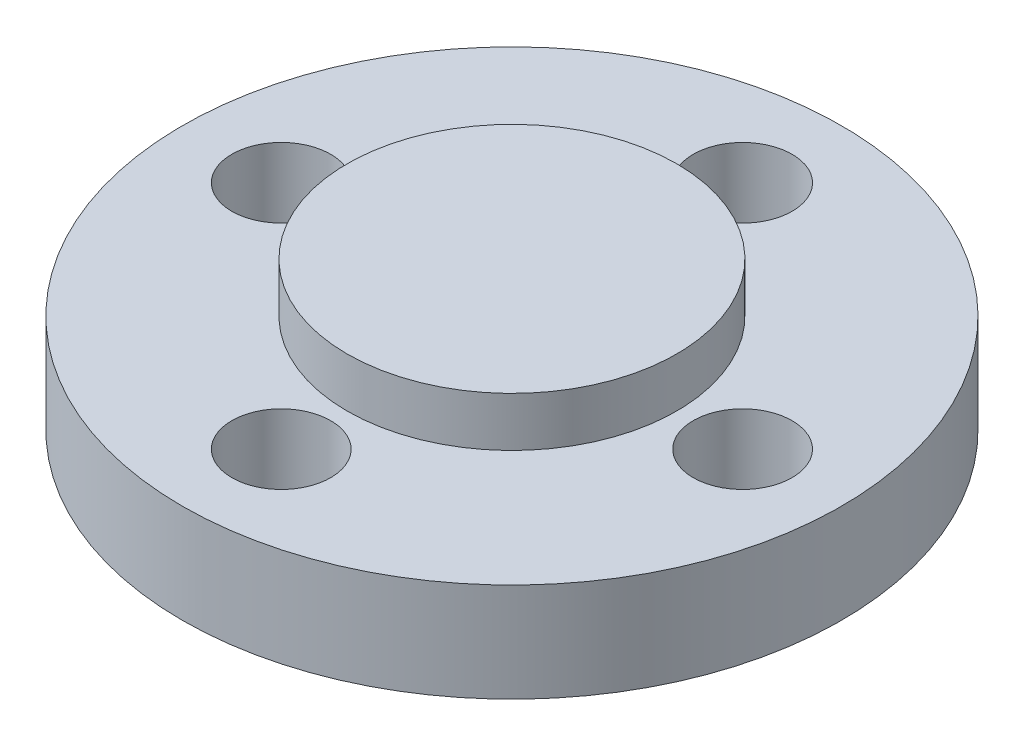
ISO-10303-21;
HEADER;
FILE_DESCRIPTION(('STEP AP214'),'2;1');
FILE_NAME('part.step','',(''),(''),'','','');
FILE_SCHEMA(('AUTOMOTIVE_DESIGN { 1 0 10303 214 1 1 1 1 }'));
ENDSEC;
DATA;
#1=APPLICATION_CONTEXT('core data for automotive mechanical design processes');
#2=APPLICATION_PROTOCOL_DEFINITION('international standard','automotive_design',2000,#1);
#3=PRODUCT_CONTEXT('',#1,'mechanical');
#4=PRODUCT('Part','Part','',(#3));
#5=PRODUCT_RELATED_PRODUCT_CATEGORY('part','',(#4));
#6=PRODUCT_DEFINITION_FORMATION('','',#4);
#7=PRODUCT_DEFINITION_CONTEXT('part definition',#1,'design');
#8=PRODUCT_DEFINITION('design','',#6,#7);
#9=PRODUCT_DEFINITION_SHAPE('','',#8);
#10=(LENGTH_UNIT() NAMED_UNIT(*) SI_UNIT(.MILLI.,.METRE.));
#11=(NAMED_UNIT(*) PLANE_ANGLE_UNIT() SI_UNIT($,.RADIAN.));
#12=(NAMED_UNIT(*) SI_UNIT($,.STERADIAN.) SOLID_ANGLE_UNIT());
#13=UNCERTAINTY_MEASURE_WITH_UNIT(LENGTH_MEASURE(1.E-05),#10,'distance_accuracy_value','');
#14=(GEOMETRIC_REPRESENTATION_CONTEXT(3) GLOBAL_UNCERTAINTY_ASSIGNED_CONTEXT((#13)) GLOBAL_UNIT_ASSIGNED_CONTEXT((#10,
#11,#12)) REPRESENTATION_CONTEXT('',''));
#15=CARTESIAN_POINT('',(0.,0.,0.));
#16=DIRECTION('',(0.,0.,1.));
#17=DIRECTION('',(1.,0.,0.));
#18=AXIS2_PLACEMENT_3D('',#15,#16,#17);
#19=CARTESIAN_POINT('',(0.,4.5,-10.));
#20=DIRECTION('',(0.,1.,0.));
#21=DIRECTION('',(0.,0.,1.));
#22=AXIS2_PLACEMENT_3D('',#19,#20,#21);
#23=PLANE('',#22);
#24=CARTESIAN_POINT('',(0.,4.5,-10.));
#25=DIRECTION('',(0.,1.,0.));
#26=DIRECTION('',(0.,0.,1.));
#27=AXIS2_PLACEMENT_3D('',#24,#25,#26);
#28=CIRCLE('',#27,5.);
#29=CARTESIAN_POINT('',(0.,4.5,-5.));
#30=VERTEX_POINT('',#29);
#31=EDGE_CURVE('E18',#30,#30,#28,.F.);
#32=ORIENTED_EDGE('',*,*,#31,.F.);
#33=EDGE_LOOP('',(#32));
#34=FACE_BOUND('',#33,.T.);
#35=ADVANCED_FACE('F15',(#34),#23,.T.);
#36=CARTESIAN_POINT('',(0.,0.,-10.));
#37=DIRECTION('',(0.,1.,0.));
#38=DIRECTION('',(0.,0.,1.));
#39=AXIS2_PLACEMENT_3D('',#36,#37,#38);
#40=CYLINDRICAL_SURFACE('',#39,5.);
#41=CARTESIAN_POINT('',(0.,3.,-10.));
#42=DIRECTION('',(0.,1.,0.));
#43=DIRECTION('',(0.,0.,1.));
#44=AXIS2_PLACEMENT_3D('',#41,#42,#43);
#45=CIRCLE('',#44,5.);
#46=CARTESIAN_POINT('',(0.,3.,-5.));
#47=VERTEX_POINT('',#46);
#48=EDGE_CURVE('E58',#47,#47,#45,.F.);
#49=ORIENTED_EDGE('',*,*,#48,.F.);
#50=EDGE_LOOP('',(#49));
#51=FACE_BOUND('',#50,.T.);
#52=ORIENTED_EDGE('',*,*,#31,.T.);
#53=EDGE_LOOP('',(#52));
#54=FACE_BOUND('',#53,.T.);
#55=ADVANCED_FACE('F65',(#51,#54),#40,.T.);
#56=CARTESIAN_POINT('',(0.,0.499999999999998,-10.));
#57=DIRECTION('',(0.,1.,0.));
#58=DIRECTION('',(0.,0.,1.));
#59=AXIS2_PLACEMENT_3D('',#56,#57,#58);
#60=PLANE('',#59);
#61=CARTESIAN_POINT('',(0.,0.499999999999998,-10.));
#62=DIRECTION('',(0.,1.,0.));
#63=DIRECTION('',(0.,0.,1.));
#64=AXIS2_PLACEMENT_3D('',#61,#62,#63);
#65=CIRCLE('',#64,1.5);
#66=CARTESIAN_POINT('',(0.,0.499999999999998,-8.5));
#67=VERTEX_POINT('',#66);
#68=EDGE_CURVE('E53',#67,#67,#65,.F.);
#69=ORIENTED_EDGE('',*,*,#68,.T.);
#70=EDGE_LOOP('',(#69));
#71=FACE_BOUND('',#70,.T.);
#72=ADVANCED_FACE('F72',(#71),#60,.F.);
#73=CARTESIAN_POINT('',(0.,3.,-10.));
#74=DIRECTION('',(0.,1.,0.));
#75=DIRECTION('',(0.,0.,1.));
#76=AXIS2_PLACEMENT_3D('',#73,#74,#75);
#77=PLANE('',#76);
#78=CARTESIAN_POINT('',(0.000441975500760455,3.,-3.00000001395303));
#79=DIRECTION('',(0.,1.,0.));
#80=DIRECTION('',(0.,0.,1.));
#81=AXIS2_PLACEMENT_3D('',#78,#79,#80);
#82=CIRCLE('',#81,1.5);
#83=CARTESIAN_POINT('',(0.000441975500760455,3.,-1.50000001395303));
#84=VERTEX_POINT('',#83);
#85=EDGE_CURVE('E41',#84,#84,#82,.F.);
#86=ORIENTED_EDGE('',*,*,#85,.T.);
#87=EDGE_LOOP('',(#86));
#88=FACE_BOUND('',#87,.T.);
#89=CARTESIAN_POINT('',(6.99999999915486,3.,-9.99989122507392));
#90=DIRECTION('',(0.,1.,0.));
#91=DIRECTION('',(0.,0.,1.));
#92=AXIS2_PLACEMENT_3D('',#89,#90,#91);
#93=CIRCLE('',#92,1.5);
#94=CARTESIAN_POINT('',(6.99999999915486,3.,-8.49989122507392));
#95=VERTEX_POINT('',#94);
#96=EDGE_CURVE('E44',#95,#95,#93,.F.);
#97=ORIENTED_EDGE('',*,*,#96,.T.);
#98=EDGE_LOOP('',(#97));
#99=FACE_BOUND('',#98,.T.);
#100=CARTESIAN_POINT('',(-7.,3.,-10.));
#101=DIRECTION('',(0.,1.,0.));
#102=DIRECTION('',(0.,0.,1.));
#103=AXIS2_PLACEMENT_3D('',#100,#101,#102);
#104=CIRCLE('',#103,1.5);
#105=CARTESIAN_POINT('',(-7.,3.,-8.5));
#106=VERTEX_POINT('',#105);
#107=EDGE_CURVE('E47',#106,#106,#104,.F.);
#108=ORIENTED_EDGE('',*,*,#107,.T.);
#109=EDGE_LOOP('',(#108));
#110=FACE_BOUND('',#109,.T.);
#111=CARTESIAN_POINT('',(0.00127737843223529,3.,-16.9999998834503));
#112=DIRECTION('',(0.,1.,0.));
#113=DIRECTION('',(0.,0.,1.));
#114=AXIS2_PLACEMENT_3D('',#111,#112,#113);
#115=CIRCLE('',#114,1.5);
#116=CARTESIAN_POINT('',(0.00127737843223529,3.,-15.4999998834503));
#117=VERTEX_POINT('',#116);
#118=EDGE_CURVE('E50',#117,#117,#115,.F.);
#119=ORIENTED_EDGE('',*,*,#118,.T.);
#120=EDGE_LOOP('',(#119));
#121=FACE_BOUND('',#120,.T.);
#122=ORIENTED_EDGE('',*,*,#48,.T.);
#123=EDGE_LOOP('',(#122));
#124=FACE_BOUND('',#123,.T.);
#125=CARTESIAN_POINT('',(0.,3.,-10.));
#126=DIRECTION('',(0.,1.,0.));
#127=DIRECTION('',(0.,0.,1.));
#128=AXIS2_PLACEMENT_3D('',#125,#126,#127);
#129=CIRCLE('',#128,10.);
#130=CARTESIAN_POINT('',(0.,3.,0.));
#131=VERTEX_POINT('',#130);
#132=EDGE_CURVE('E56',#131,#131,#129,.F.);
#133=ORIENTED_EDGE('',*,*,#132,.F.);
#134=EDGE_LOOP('',(#133));
#135=FACE_BOUND('',#134,.T.);
#136=ADVANCED_FACE('F105',(#88,#99,#110,#121,#124,#135),#77,.T.);
#137=CARTESIAN_POINT('',(0.,0.,-10.));
#138=DIRECTION('',(0.,1.,0.));
#139=DIRECTION('',(0.,0.,1.));
#140=AXIS2_PLACEMENT_3D('',#137,#138,#139);
#141=CYLINDRICAL_SURFACE('',#140,10.);
#142=CARTESIAN_POINT('',(0.,0.,-10.));
#143=DIRECTION('',(0.,1.,0.));
#144=DIRECTION('',(0.,0.,1.));
#145=AXIS2_PLACEMENT_3D('',#142,#143,#144);
#146=CIRCLE('',#145,10.);
#147=CARTESIAN_POINT('',(0.,0.,0.));
#148=VERTEX_POINT('',#147);
#149=EDGE_CURVE('E38',#148,#148,#146,.T.);
#150=ORIENTED_EDGE('',*,*,#149,.T.);
#151=EDGE_LOOP('',(#150));
#152=FACE_BOUND('',#151,.T.);
#153=ORIENTED_EDGE('',*,*,#132,.T.);
#154=EDGE_LOOP('',(#153));
#155=FACE_BOUND('',#154,.T.);
#156=ADVANCED_FACE('F101',(#152,#155),#141,.T.);
#157=CARTESIAN_POINT('',(0.,0.,-10.));
#158=DIRECTION('',(0.,1.,0.));
#159=DIRECTION('',(0.,0.,1.));
#160=AXIS2_PLACEMENT_3D('',#157,#158,#159);
#161=CYLINDRICAL_SURFACE('',#160,1.5);
#162=ORIENTED_EDGE('',*,*,#68,.F.);
#163=EDGE_LOOP('',(#162));
#164=FACE_BOUND('',#163,.T.);
#165=CARTESIAN_POINT('',(0.,0.,-10.));
#166=DIRECTION('',(0.,1.,0.));
#167=DIRECTION('',(0.,0.,1.));
#168=AXIS2_PLACEMENT_3D('',#165,#166,#167);
#169=CIRCLE('',#168,1.5);
#170=CARTESIAN_POINT('',(0.,0.,-8.5));
#171=VERTEX_POINT('',#170);
#172=EDGE_CURVE('E35',#171,#171,#169,.F.);
#173=ORIENTED_EDGE('',*,*,#172,.T.);
#174=EDGE_LOOP('',(#173));
#175=FACE_BOUND('',#174,.T.);
#176=ADVANCED_FACE('F97',(#164,#175),#161,.F.);
#177=CARTESIAN_POINT('',(0.00127737843223529,0.,-16.9999998834503));
#178=DIRECTION('',(0.,1.,0.));
#179=DIRECTION('',(0.,0.,1.));
#180=AXIS2_PLACEMENT_3D('',#177,#178,#179);
#181=CYLINDRICAL_SURFACE('',#180,1.5);
#182=ORIENTED_EDGE('',*,*,#118,.F.);
#183=EDGE_LOOP('',(#182));
#184=FACE_BOUND('',#183,.T.);
#185=CARTESIAN_POINT('',(0.00127737843223529,0.,-16.9999998834503));
#186=DIRECTION('',(0.,1.,0.));
#187=DIRECTION('',(0.,0.,1.));
#188=AXIS2_PLACEMENT_3D('',#185,#186,#187);
#189=CIRCLE('',#188,1.5);
#190=CARTESIAN_POINT('',(0.00127737843223529,0.,-15.4999998834503));
#191=VERTEX_POINT('',#190);
#192=EDGE_CURVE('E32',#191,#191,#189,.F.);
#193=ORIENTED_EDGE('',*,*,#192,.T.);
#194=EDGE_LOOP('',(#193));
#195=FACE_BOUND('',#194,.T.);
#196=ADVANCED_FACE('F93',(#184,#195),#181,.F.);
#197=CARTESIAN_POINT('',(-7.,0.,-10.));
#198=DIRECTION('',(0.,1.,0.));
#199=DIRECTION('',(0.,0.,1.));
#200=AXIS2_PLACEMENT_3D('',#197,#198,#199);
#201=CYLINDRICAL_SURFACE('',#200,1.5);
#202=ORIENTED_EDGE('',*,*,#107,.F.);
#203=EDGE_LOOP('',(#202));
#204=FACE_BOUND('',#203,.T.);
#205=CARTESIAN_POINT('',(-7.,0.,-10.));
#206=DIRECTION('',(0.,1.,0.));
#207=DIRECTION('',(0.,0.,1.));
#208=AXIS2_PLACEMENT_3D('',#205,#206,#207);
#209=CIRCLE('',#208,1.5);
#210=CARTESIAN_POINT('',(-7.,0.,-8.5));
#211=VERTEX_POINT('',#210);
#212=EDGE_CURVE('E27',#211,#211,#209,.F.);
#213=ORIENTED_EDGE('',*,*,#212,.T.);
#214=EDGE_LOOP('',(#213));
#215=FACE_BOUND('',#214,.T.);
#216=ADVANCED_FACE('F89',(#204,#215),#201,.F.);
#217=CARTESIAN_POINT('',(6.99999999915486,0.,-9.99989122507392));
#218=DIRECTION('',(0.,1.,0.));
#219=DIRECTION('',(0.,0.,1.));
#220=AXIS2_PLACEMENT_3D('',#217,#218,#219);
#221=CYLINDRICAL_SURFACE('',#220,1.5);
#222=ORIENTED_EDGE('',*,*,#96,.F.);
#223=EDGE_LOOP('',(#222));
#224=FACE_BOUND('',#223,.T.);
#225=CARTESIAN_POINT('',(6.99999999915486,0.,-9.99989122507392));
#226=DIRECTION('',(0.,1.,0.));
#227=DIRECTION('',(0.,0.,1.));
#228=AXIS2_PLACEMENT_3D('',#225,#226,#227);
#229=CIRCLE('',#228,1.5);
#230=CARTESIAN_POINT('',(6.99999999915486,0.,-8.49989122507392));
#231=VERTEX_POINT('',#230);
#232=EDGE_CURVE('E22',#231,#231,#229,.F.);
#233=ORIENTED_EDGE('',*,*,#232,.T.);
#234=EDGE_LOOP('',(#233));
#235=FACE_BOUND('',#234,.T.);
#236=ADVANCED_FACE('F82',(#224,#235),#221,.F.);
#237=CARTESIAN_POINT('',(0.000441975500760455,0.,-3.00000001395303));
#238=DIRECTION('',(0.,1.,0.));
#239=DIRECTION('',(0.,0.,1.));
#240=AXIS2_PLACEMENT_3D('',#237,#238,#239);
#241=CYLINDRICAL_SURFACE('',#240,1.5);
#242=ORIENTED_EDGE('',*,*,#85,.F.);
#243=EDGE_LOOP('',(#242));
#244=FACE_BOUND('',#243,.T.);
#245=CARTESIAN_POINT('',(0.000441975500760455,0.,-3.00000001395303));
#246=DIRECTION('',(0.,1.,0.));
#247=DIRECTION('',(0.,0.,1.));
#248=AXIS2_PLACEMENT_3D('',#245,#246,#247);
#249=CIRCLE('',#248,1.5);
#250=CARTESIAN_POINT('',(0.000441975500760455,0.,-1.50000001395303));
#251=VERTEX_POINT('',#250);
#252=EDGE_CURVE('E10',#251,#251,#249,.F.);
#253=ORIENTED_EDGE('',*,*,#252,.T.);
#254=EDGE_LOOP('',(#253));
#255=FACE_BOUND('',#254,.T.);
#256=ADVANCED_FACE('F76',(#244,#255),#241,.F.);
#257=CARTESIAN_POINT('',(0.,0.,-10.));
#258=DIRECTION('',(0.,1.,0.));
#259=DIRECTION('',(0.,0.,1.));
#260=AXIS2_PLACEMENT_3D('',#257,#258,#259);
#261=PLANE('',#260);
#262=ORIENTED_EDGE('',*,*,#252,.F.);
#263=EDGE_LOOP('',(#262));
#264=FACE_BOUND('',#263,.T.);
#265=ORIENTED_EDGE('',*,*,#232,.F.);
#266=EDGE_LOOP('',(#265));
#267=FACE_BOUND('',#266,.T.);
#268=ORIENTED_EDGE('',*,*,#212,.F.);
#269=EDGE_LOOP('',(#268));
#270=FACE_BOUND('',#269,.T.);
#271=ORIENTED_EDGE('',*,*,#192,.F.);
#272=EDGE_LOOP('',(#271));
#273=FACE_BOUND('',#272,.T.);
#274=ORIENTED_EDGE('',*,*,#172,.F.);
#275=EDGE_LOOP('',(#274));
#276=FACE_BOUND('',#275,.T.);
#277=ORIENTED_EDGE('',*,*,#149,.F.);
#278=EDGE_LOOP('',(#277));
#279=FACE_BOUND('',#278,.T.);
#280=ADVANCED_FACE('F74',(#264,#267,#270,#273,#276,#279),#261,.F.);
#281=CLOSED_SHELL('',(#35,#55,#72,#136,#156,#176,#196,#216,#236,#256,#280));
#282=MANIFOLD_SOLID_BREP('B1',#281);
#283=ADVANCED_BREP_SHAPE_REPRESENTATION('',(#18,#282),#14);
#284=SHAPE_DEFINITION_REPRESENTATION(#9,#283);
ENDSEC;
END-ISO-10303-21;
